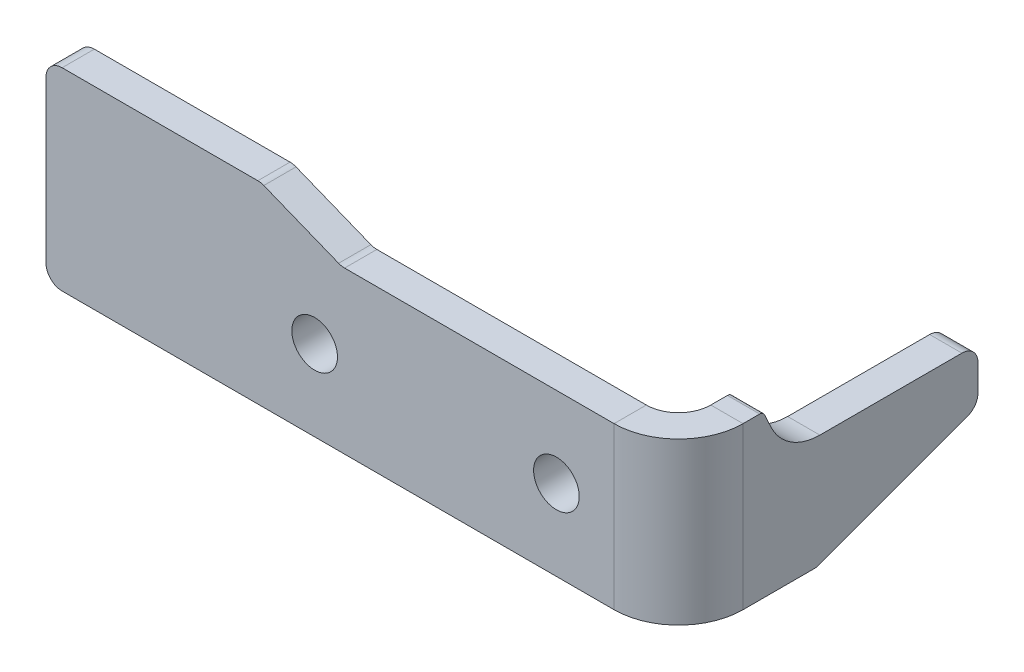
ISO-10303-21;
HEADER;
FILE_DESCRIPTION(('STEP AP214'),'2;1');
FILE_NAME('part.step','',(''),(''),'','','');
FILE_SCHEMA(('AUTOMOTIVE_DESIGN { 1 0 10303 214 1 1 1 1 }'));
ENDSEC;
DATA;
#1=APPLICATION_CONTEXT('core data for automotive mechanical design processes');
#2=APPLICATION_PROTOCOL_DEFINITION('international standard','automotive_design',2000,#1);
#3=PRODUCT_CONTEXT('',#1,'mechanical');
#4=PRODUCT('Part','Part','',(#3));
#5=PRODUCT_RELATED_PRODUCT_CATEGORY('part','',(#4));
#6=PRODUCT_DEFINITION_FORMATION('','',#4);
#7=PRODUCT_DEFINITION_CONTEXT('part definition',#1,'design');
#8=PRODUCT_DEFINITION('design','',#6,#7);
#9=PRODUCT_DEFINITION_SHAPE('','',#8);
#10=(LENGTH_UNIT() NAMED_UNIT(*) SI_UNIT(.MILLI.,.METRE.));
#11=(NAMED_UNIT(*) PLANE_ANGLE_UNIT() SI_UNIT($,.RADIAN.));
#12=(NAMED_UNIT(*) SI_UNIT($,.STERADIAN.) SOLID_ANGLE_UNIT());
#13=UNCERTAINTY_MEASURE_WITH_UNIT(LENGTH_MEASURE(1.E-05),#10,'distance_accuracy_value','');
#14=(GEOMETRIC_REPRESENTATION_CONTEXT(3) GLOBAL_UNCERTAINTY_ASSIGNED_CONTEXT((#13)) GLOBAL_UNIT_ASSIGNED_CONTEXT((#10,
#11,#12)) REPRESENTATION_CONTEXT('',''));
#15=CARTESIAN_POINT('',(0.,0.,0.));
#16=DIRECTION('',(0.,0.,1.));
#17=DIRECTION('',(1.,0.,0.));
#18=AXIS2_PLACEMENT_3D('',#15,#16,#17);
#19=CARTESIAN_POINT('',(-44.2674773439117,8.42261826174068,-10.0017601823175));
#20=DIRECTION('',(0.,-0.422618261740698,0.906307787036651));
#21=DIRECTION('',(0.,-0.906307787036651,-0.422618261740698));
#22=AXIS2_PLACEMENT_3D('',#19,#20,#21);
#23=PLANE('',#22);
#24=DIRECTION('',(0.,0.906307787036651,0.422618261740698));
#25=VECTOR('',#24,1.);
#26=CARTESIAN_POINT('',(-50.2674773439117,8.42261826174068,-10.0017601823175));
#27=LINE('',#26,#25);
#28=CARTESIAN_POINT('',(-50.2674773439117,5.77381738259303,-11.2369163171918));
#29=VERTEX_POINT('',#28);
#30=CARTESIAN_POINT('',(-50.2674773439117,8.42261826174068,-10.0017601823175));
#31=VERTEX_POINT('',#30);
#32=EDGE_CURVE('E230',#29,#31,#27,.T.);
#33=ORIENTED_EDGE('',*,*,#32,.T.);
#34=DIRECTION('',(-1.,0.,0.));
#35=VECTOR('',#34,1.);
#36=CARTESIAN_POINT('',(-44.2674773439117,8.42261826174068,-10.0017601823175));
#37=LINE('',#36,#35);
#38=CARTESIAN_POINT('',(-44.2674773439117,8.42261826174068,-10.0017601823175));
#39=VERTEX_POINT('',#38);
#40=EDGE_CURVE('E274',#39,#31,#37,.T.);
#41=ORIENTED_EDGE('',*,*,#40,.F.);
#42=DIRECTION('',(0.,0.906307787036651,0.422618261740698));
#43=VECTOR('',#42,1.);
#44=CARTESIAN_POINT('',(-44.2674773439117,8.42261826174068,-10.0017601823175));
#45=LINE('',#44,#43);
#46=CARTESIAN_POINT('',(-44.2674773439117,5.77381738259303,-11.2369163171918));
#47=VERTEX_POINT('',#46);
#48=EDGE_CURVE('E296',#47,#39,#45,.T.);
#49=ORIENTED_EDGE('',*,*,#48,.F.);
#50=DIRECTION('',(-1.,0.,0.));
#51=VECTOR('',#50,1.);
#52=CARTESIAN_POINT('',(-44.2674773439117,5.77381738259303,-11.2369163171918));
#53=LINE('',#52,#51);
#54=EDGE_CURVE('E232',#47,#29,#53,.T.);
#55=ORIENTED_EDGE('',*,*,#54,.T.);
#56=EDGE_LOOP('',(#33,#41,#49,#55));
#57=FACE_BOUND('',#56,.T.);
#58=ADVANCED_FACE('F39',(#57),#23,.F.);
#59=CARTESIAN_POINT('',(-44.2674773439117,10.,-20.2999941875583));
#60=DIRECTION('',(-1.,0.,0.));
#61=DIRECTION('',(0.,0.,1.));
#62=AXIS2_PLACEMENT_3D('',#59,#60,#61);
#63=CYLINDRICAL_SURFACE('',#62,10.);
#64=CARTESIAN_POINT('',(-50.2674773439117,10.,-20.2999941875583));
#65=DIRECTION('',(-1.,0.,0.));
#66=DIRECTION('',(0.,0.,-1.));
#67=AXIS2_PLACEMENT_3D('',#64,#65,#66);
#68=CIRCLE('',#67,10.);
#69=CARTESIAN_POINT('',(-50.2674773439117,0.,-20.2999941875583));
#70=VERTEX_POINT('',#69);
#71=EDGE_CURVE('E238',#70,#29,#68,.T.);
#72=ORIENTED_EDGE('',*,*,#71,.T.);
#73=ORIENTED_EDGE('',*,*,#54,.F.);
#74=CARTESIAN_POINT('',(-44.2674773439117,10.,-20.2999941875583));
#75=DIRECTION('',(-1.,0.,0.));
#76=DIRECTION('',(0.,0.,-1.));
#77=AXIS2_PLACEMENT_3D('',#74,#75,#76);
#78=CIRCLE('',#77,10.);
#79=CARTESIAN_POINT('',(-44.2674773439117,0.,-20.2999941875583));
#80=VERTEX_POINT('',#79);
#81=EDGE_CURVE('E294',#80,#47,#78,.T.);
#82=ORIENTED_EDGE('',*,*,#81,.F.);
#83=DIRECTION('',(-1.,0.,0.));
#84=VECTOR('',#83,1.);
#85=CARTESIAN_POINT('',(-44.2674773439117,0.,-20.2999941875583));
#86=LINE('',#85,#84);
#87=EDGE_CURVE('E240',#80,#70,#86,.T.);
#88=ORIENTED_EDGE('',*,*,#87,.T.);
#89=EDGE_LOOP('',(#72,#73,#82,#88));
#90=FACE_BOUND('',#89,.T.);
#91=ADVANCED_FACE('F396',(#90),#63,.F.);
#92=CARTESIAN_POINT('',(-44.2674773439117,0.,-20.2999941875583));
#93=DIRECTION('',(0.,-1.,0.));
#94=DIRECTION('',(-1.,0.,0.));
#95=AXIS2_PLACEMENT_3D('',#92,#93,#94);
#96=PLANE('',#95);
#97=DIRECTION('',(0.,0.,1.));
#98=VECTOR('',#97,1.);
#99=CARTESIAN_POINT('',(-50.2674773439117,0.,-20.2999941875583));
#100=LINE('',#99,#98);
#101=CARTESIAN_POINT('',(-50.2674773439118,0.,-46.7325226560883));
#102=VERTEX_POINT('',#101);
#103=EDGE_CURVE('E243',#102,#70,#100,.T.);
#104=ORIENTED_EDGE('',*,*,#103,.T.);
#105=ORIENTED_EDGE('',*,*,#87,.F.);
#106=DIRECTION('',(0.,0.,1.));
#107=VECTOR('',#106,1.);
#108=CARTESIAN_POINT('',(-44.2674773439117,0.,-20.2999941875583));
#109=LINE('',#108,#107);
#110=CARTESIAN_POINT('',(-44.2674773439118,0.,-46.7325226560884));
#111=VERTEX_POINT('',#110);
#112=EDGE_CURVE('E292',#111,#80,#109,.T.);
#113=ORIENTED_EDGE('',*,*,#112,.F.);
#114=DIRECTION('',(-1.,0.,0.));
#115=VECTOR('',#114,1.);
#116=CARTESIAN_POINT('',(-44.2674773439118,0.,-46.7325226560884));
#117=LINE('',#116,#115);
#118=EDGE_CURVE('E245',#111,#102,#117,.T.);
#119=ORIENTED_EDGE('',*,*,#118,.T.);
#120=EDGE_LOOP('',(#104,#105,#113,#119));
#121=FACE_BOUND('',#120,.T.);
#122=ADVANCED_FACE('F402',(#121),#96,.F.);
#123=CARTESIAN_POINT('',(-44.2674773439118,-3.,-46.7325226560884));
#124=DIRECTION('',(-1.,0.,0.));
#125=DIRECTION('',(0.,0.,1.));
#126=AXIS2_PLACEMENT_3D('',#123,#124,#125);
#127=CYLINDRICAL_SURFACE('',#126,3.);
#128=CARTESIAN_POINT('',(-50.2674773439118,-3.,-46.7325226560884));
#129=DIRECTION('',(1.,0.,0.));
#130=DIRECTION('',(0.,0.,1.));
#131=AXIS2_PLACEMENT_3D('',#128,#129,#130);
#132=CIRCLE('',#131,3.);
#133=CARTESIAN_POINT('',(-50.2674773439118,-3.00000000000002,-49.7325226560884));
#134=VERTEX_POINT('',#133);
#135=EDGE_CURVE('E248',#134,#102,#132,.T.);
#136=ORIENTED_EDGE('',*,*,#135,.T.);
#137=ORIENTED_EDGE('',*,*,#118,.F.);
#138=CARTESIAN_POINT('',(-44.2674773439118,-3.,-46.7325226560884));
#139=DIRECTION('',(1.,0.,0.));
#140=DIRECTION('',(0.,0.,1.));
#141=AXIS2_PLACEMENT_3D('',#138,#139,#140);
#142=CIRCLE('',#141,3.);
#143=CARTESIAN_POINT('',(-44.2674773439118,-3.00000000000002,-49.7325226560884));
#144=VERTEX_POINT('',#143);
#145=EDGE_CURVE('E290',#144,#111,#142,.T.);
#146=ORIENTED_EDGE('',*,*,#145,.F.);
#147=DIRECTION('',(-1.,0.,0.));
#148=VECTOR('',#147,1.);
#149=CARTESIAN_POINT('',(-44.2674773439118,-3.00000000000002,-49.7325226560884));
#150=LINE('',#149,#148);
#151=EDGE_CURVE('E250',#144,#134,#150,.T.);
#152=ORIENTED_EDGE('',*,*,#151,.T.);
#153=EDGE_LOOP('',(#136,#137,#146,#152));
#154=FACE_BOUND('',#153,.T.);
#155=ADVANCED_FACE('F411',(#154),#127,.T.);
#156=CARTESIAN_POINT('',(-44.2674773439118,-3.00000000000002,-49.7325226560884));
#157=DIRECTION('',(0.,0.,1.));
#158=DIRECTION('',(1.,0.,0.));
#159=AXIS2_PLACEMENT_3D('',#156,#157,#158);
#160=PLANE('',#159);
#161=DIRECTION('',(0.,1.,0.));
#162=VECTOR('',#161,1.);
#163=CARTESIAN_POINT('',(-50.2674773439118,-3.00000000000002,-49.7325226560884));
#164=LINE('',#163,#162);
#165=CARTESIAN_POINT('',(-50.2674773439118,-7.90469093826589,-49.7325226560884));
#166=VERTEX_POINT('',#165);
#167=EDGE_CURVE('E253',#166,#134,#164,.T.);
#168=ORIENTED_EDGE('',*,*,#167,.T.);
#169=ORIENTED_EDGE('',*,*,#151,.F.);
#170=DIRECTION('',(0.,1.,0.));
#171=VECTOR('',#170,1.);
#172=CARTESIAN_POINT('',(-44.2674773439118,-3.00000000000002,-49.7325226560884));
#173=LINE('',#172,#171);
#174=CARTESIAN_POINT('',(-44.2674773439118,-7.90469093826589,-49.7325226560884));
#175=VERTEX_POINT('',#174);
#176=EDGE_CURVE('E288',#175,#144,#173,.T.);
#177=ORIENTED_EDGE('',*,*,#176,.F.);
#178=DIRECTION('',(-1.,0.,0.));
#179=VECTOR('',#178,1.);
#180=CARTESIAN_POINT('',(-44.2674773439118,-7.90469093826589,-49.7325226560884));
#181=LINE('',#180,#179);
#182=EDGE_CURVE('E255',#175,#166,#181,.T.);
#183=ORIENTED_EDGE('',*,*,#182,.T.);
#184=EDGE_LOOP('',(#168,#169,#177,#183));
#185=FACE_BOUND('',#184,.T.);
#186=ADVANCED_FACE('F415',(#185),#160,.F.);
#187=CARTESIAN_POINT('',(-44.2674773439118,-7.90469093826591,-46.7325226560884));
#188=DIRECTION('',(-1.,0.,0.));
#189=DIRECTION('',(0.,0.,1.));
#190=AXIS2_PLACEMENT_3D('',#187,#188,#189);
#191=CYLINDRICAL_SURFACE('',#190,3.);
#192=CARTESIAN_POINT('',(-50.2674773439118,-7.90469093826591,-46.7325226560884));
#193=DIRECTION('',(1.,0.,0.));
#194=DIRECTION('',(0.,0.,-1.));
#195=AXIS2_PLACEMENT_3D('',#192,#193,#194);
#196=CIRCLE('',#195,3.);
#197=CARTESIAN_POINT('',(-50.2674773439118,-10.7213198859257,-47.7652866035636));
#198=VERTEX_POINT('',#197);
#199=EDGE_CURVE('E258',#198,#166,#196,.T.);
#200=ORIENTED_EDGE('',*,*,#199,.T.);
#201=ORIENTED_EDGE('',*,*,#182,.F.);
#202=CARTESIAN_POINT('',(-44.2674773439118,-7.90469093826591,-46.7325226560884));
#203=DIRECTION('',(1.,0.,0.));
#204=DIRECTION('',(0.,0.,-1.));
#205=AXIS2_PLACEMENT_3D('',#202,#203,#204);
#206=CIRCLE('',#205,3.);
#207=CARTESIAN_POINT('',(-44.2674773439118,-10.7213198859257,-47.7652866035636));
#208=VERTEX_POINT('',#207);
#209=EDGE_CURVE('E286',#208,#175,#206,.T.);
#210=ORIENTED_EDGE('',*,*,#209,.F.);
#211=DIRECTION('',(-1.,0.,0.));
#212=VECTOR('',#211,1.);
#213=CARTESIAN_POINT('',(-44.2674773439118,-10.7213198859257,-47.7652866035636));
#214=LINE('',#213,#212);
#215=EDGE_CURVE('E260',#208,#198,#214,.T.);
#216=ORIENTED_EDGE('',*,*,#215,.T.);
#217=EDGE_LOOP('',(#200,#201,#210,#216));
#218=FACE_BOUND('',#217,.T.);
#219=ADVANCED_FACE('F419',(#218),#191,.T.);
#220=CARTESIAN_POINT('',(-44.2674773439118,-10.7213198859257,-47.7652866035636));
#221=DIRECTION('',(0.,0.938876315886609,0.344254649158423));
#222=DIRECTION('',(0.,-0.344254649158423,0.938876315886609));
#223=AXIS2_PLACEMENT_3D('',#220,#221,#222);
#224=PLANE('',#223);
#225=DIRECTION('',(0.,0.344254649158423,-0.938876315886609));
#226=VECTOR('',#225,1.);
#227=CARTESIAN_POINT('',(-50.2674773439118,-10.7213198859257,-47.7652866035636));
#228=LINE('',#227,#226);
#229=CARTESIAN_POINT('',(-50.2674773439117,-20.8166289476598,-20.232625526107));
#230=VERTEX_POINT('',#229);
#231=EDGE_CURVE('E263',#230,#198,#228,.T.);
#232=ORIENTED_EDGE('',*,*,#231,.T.);
#233=ORIENTED_EDGE('',*,*,#215,.F.);
#234=DIRECTION('',(0.,0.344254649158423,-0.938876315886609));
#235=VECTOR('',#234,1.);
#236=CARTESIAN_POINT('',(-44.2674773439118,-10.7213198859257,-47.7652866035636));
#237=LINE('',#236,#235);
#238=CARTESIAN_POINT('',(-44.2674773439117,-20.8166289476598,-20.2326255261071));
#239=VERTEX_POINT('',#238);
#240=EDGE_CURVE('E284',#239,#208,#237,.T.);
#241=ORIENTED_EDGE('',*,*,#240,.F.);
#242=DIRECTION('',(-1.,0.,0.));
#243=VECTOR('',#242,1.);
#244=CARTESIAN_POINT('',(-44.2674773439117,-20.8166289476598,-20.2326255261071));
#245=LINE('',#244,#243);
#246=EDGE_CURVE('E265',#239,#230,#245,.T.);
#247=ORIENTED_EDGE('',*,*,#246,.T.);
#248=EDGE_LOOP('',(#232,#233,#241,#247));
#249=FACE_BOUND('',#248,.T.);
#250=ADVANCED_FACE('F423',(#249),#224,.F.);
#251=CARTESIAN_POINT('',(-44.2674773439117,-18.,-19.1998615786318));
#252=DIRECTION('',(-1.,0.,0.));
#253=DIRECTION('',(0.,0.,1.));
#254=AXIS2_PLACEMENT_3D('',#251,#252,#253);
#255=CYLINDRICAL_SURFACE('',#254,3.);
#256=CARTESIAN_POINT('',(-50.2674773439117,-18.,-19.1998615786318));
#257=DIRECTION('',(1.,0.,0.));
#258=DIRECTION('',(0.,0.,1.));
#259=AXIS2_PLACEMENT_3D('',#256,#257,#258);
#260=CIRCLE('',#259,3.);
#261=CARTESIAN_POINT('',(-50.2674773439117,-21.,-19.1998615786318));
#262=VERTEX_POINT('',#261);
#263=EDGE_CURVE('E268',#262,#230,#260,.T.);
#264=ORIENTED_EDGE('',*,*,#263,.T.);
#265=ORIENTED_EDGE('',*,*,#246,.F.);
#266=CARTESIAN_POINT('',(-44.2674773439117,-18.,-19.1998615786318));
#267=DIRECTION('',(1.,0.,0.));
#268=DIRECTION('',(0.,0.,1.));
#269=AXIS2_PLACEMENT_3D('',#266,#267,#268);
#270=CIRCLE('',#269,3.);
#271=CARTESIAN_POINT('',(-44.2674773439117,-21.,-19.1998615786318));
#272=VERTEX_POINT('',#271);
#273=EDGE_CURVE('E282',#272,#239,#270,.T.);
#274=ORIENTED_EDGE('',*,*,#273,.F.);
#275=DIRECTION('',(-1.,0.,0.));
#276=VECTOR('',#275,1.);
#277=CARTESIAN_POINT('',(-44.2674773439117,-21.,-19.1998615786318));
#278=LINE('',#277,#276);
#279=EDGE_CURVE('E270',#272,#262,#278,.T.);
#280=ORIENTED_EDGE('',*,*,#279,.T.);
#281=EDGE_LOOP('',(#264,#265,#274,#280));
#282=FACE_BOUND('',#281,.T.);
#283=ADVANCED_FACE('F427',(#282),#255,.T.);
#284=CARTESIAN_POINT('',(-44.2674773439117,7.99999999999999,-9.0954523952809));
#285=DIRECTION('',(-1.,0.,0.));
#286=DIRECTION('',(0.,0.,1.));
#287=AXIS2_PLACEMENT_3D('',#284,#285,#286);
#288=CYLINDRICAL_SURFACE('',#287,1.);
#289=CARTESIAN_POINT('',(-50.2674773439117,7.99999999999999,-9.09545239528087));
#290=DIRECTION('',(1.,0.,0.));
#291=DIRECTION('',(0.,0.,1.));
#292=AXIS2_PLACEMENT_3D('',#289,#290,#291);
#293=CIRCLE('',#292,1.);
#294=CARTESIAN_POINT('',(-50.2674773439117,8.99999999999999,-9.09545239528087));
#295=VERTEX_POINT('',#294);
#296=EDGE_CURVE('E272',#31,#295,#293,.T.);
#297=ORIENTED_EDGE('',*,*,#296,.T.);
#298=DIRECTION('',(-1.,0.,0.));
#299=VECTOR('',#298,1.);
#300=CARTESIAN_POINT('',(-44.2674773439117,8.99999999999999,-9.0954523952809));
#301=LINE('',#300,#299);
#302=CARTESIAN_POINT('',(-44.2674773439117,8.99999999999999,-9.0954523952809));
#303=VERTEX_POINT('',#302);
#304=EDGE_CURVE('E277',#303,#295,#301,.T.);
#305=ORIENTED_EDGE('',*,*,#304,.F.);
#306=CARTESIAN_POINT('',(-44.2674773439117,7.99999999999999,-9.0954523952809));
#307=DIRECTION('',(1.,0.,0.));
#308=DIRECTION('',(0.,0.,1.));
#309=AXIS2_PLACEMENT_3D('',#306,#307,#308);
#310=CIRCLE('',#309,1.);
#311=EDGE_CURVE('E203',#39,#303,#310,.T.);
#312=ORIENTED_EDGE('',*,*,#311,.F.);
#313=ORIENTED_EDGE('',*,*,#40,.T.);
#314=EDGE_LOOP('',(#297,#305,#312,#313));
#315=FACE_BOUND('',#314,.T.);
#316=ADVANCED_FACE('F431',(#315),#288,.T.);
#317=CARTESIAN_POINT('',(-44.2674773439114,8.99999999999999,56.6897301332098));
#318=DIRECTION('',(0.,-1.,0.));
#319=DIRECTION('',(0.,0.,-1.));
#320=AXIS2_PLACEMENT_3D('',#317,#318,#319);
#321=PLANE('',#320);
#322=DIRECTION('',(-1.,0.,0.));
#323=VECTOR('',#322,1.);
#324=CARTESIAN_POINT('',(-44.2674773439117,8.99999999999999,-6.00000000000003));
#325=LINE('',#324,#323);
#326=CARTESIAN_POINT('',(-44.2674773439117,8.99999999999998,-6.));
#327=VERTEX_POINT('',#326);
#328=CARTESIAN_POINT('',(-50.2674773439117,8.99999999999999,-6.00000000000001));
#329=VERTEX_POINT('',#328);
#330=EDGE_CURVE('E43',#327,#329,#325,.T.);
#331=ORIENTED_EDGE('',*,*,#330,.F.);
#332=DIRECTION('',(0.,0.,1.));
#333=VECTOR('',#332,1.);
#334=CARTESIAN_POINT('',(-44.2674773439114,8.99999999999999,56.6897301332098));
#335=LINE('',#334,#333);
#336=EDGE_CURVE('E199',#303,#327,#335,.T.);
#337=ORIENTED_EDGE('',*,*,#336,.F.);
#338=ORIENTED_EDGE('',*,*,#304,.T.);
#339=DIRECTION('',(0.,0.,1.));
#340=VECTOR('',#339,1.);
#341=CARTESIAN_POINT('',(-50.2674773439114,8.99999999999999,56.6897301332098));
#342=LINE('',#341,#340);
#343=EDGE_CURVE('E211',#295,#329,#342,.T.);
#344=ORIENTED_EDGE('',*,*,#343,.T.);
#345=EDGE_LOOP('',(#331,#337,#338,#344));
#346=FACE_BOUND('',#345,.T.);
#347=ADVANCED_FACE('F210',(#346),#321,.F.);
#348=CARTESIAN_POINT('',(-44.2674773439113,-18.,109.267477343912));
#349=DIRECTION('',(-1.,0.,0.));
#350=DIRECTION('',(0.,0.,1.));
#351=AXIS2_PLACEMENT_3D('',#348,#349,#350);
#352=PLANE('',#351);
#353=DIRECTION('',(0.,1.,0.));
#354=VECTOR('',#353,1.);
#355=CARTESIAN_POINT('',(-44.2674773439117,-18.,-6.00000000000005));
#356=LINE('',#355,#354);
#357=CARTESIAN_POINT('',(-44.2674773439117,-21.,-6.00000000000004));
#358=VERTEX_POINT('',#357);
#359=EDGE_CURVE('E125',#358,#327,#356,.T.);
#360=ORIENTED_EDGE('',*,*,#359,.F.);
#361=DIRECTION('',(0.,0.,-1.));
#362=VECTOR('',#361,1.);
#363=CARTESIAN_POINT('',(-44.2674773439117,-21.,-19.1998615786318));
#364=LINE('',#363,#362);
#365=EDGE_CURVE('E280',#358,#272,#364,.T.);
#366=ORIENTED_EDGE('',*,*,#365,.T.);
#367=ORIENTED_EDGE('',*,*,#273,.T.);
#368=ORIENTED_EDGE('',*,*,#240,.T.);
#369=ORIENTED_EDGE('',*,*,#209,.T.);
#370=ORIENTED_EDGE('',*,*,#176,.T.);
#371=ORIENTED_EDGE('',*,*,#145,.T.);
#372=ORIENTED_EDGE('',*,*,#112,.T.);
#373=ORIENTED_EDGE('',*,*,#81,.T.);
#374=ORIENTED_EDGE('',*,*,#48,.T.);
#375=ORIENTED_EDGE('',*,*,#311,.T.);
#376=ORIENTED_EDGE('',*,*,#336,.T.);
#377=EDGE_LOOP('',(#360,#366,#367,#368,#369,#370,#371,#372,#373,#374,#375,#376));
#378=FACE_BOUND('',#377,.T.);
#379=ADVANCED_FACE('F201',(#378),#352,.F.);
#380=CARTESIAN_POINT('',(-44.2674773439117,-21.,-19.1998615786318));
#381=DIRECTION('',(0.,1.,0.));
#382=DIRECTION('',(0.,0.,1.));
#383=AXIS2_PLACEMENT_3D('',#380,#381,#382);
#384=PLANE('',#383);
#385=DIRECTION('',(1.,0.,0.));
#386=VECTOR('',#385,1.);
#387=CARTESIAN_POINT('',(-44.2674773439117,-21.,-6.00000000000004));
#388=LINE('',#387,#386);
#389=CARTESIAN_POINT('',(-50.2674773439117,-21.,-6.00000000000002));
#390=VERTEX_POINT('',#389);
#391=EDGE_CURVE('E215',#390,#358,#388,.T.);
#392=ORIENTED_EDGE('',*,*,#391,.F.);
#393=DIRECTION('',(0.,0.,-1.));
#394=VECTOR('',#393,1.);
#395=CARTESIAN_POINT('',(-50.2674773439117,-21.,-19.1998615786318));
#396=LINE('',#395,#394);
#397=EDGE_CURVE('E49',#390,#262,#396,.T.);
#398=ORIENTED_EDGE('',*,*,#397,.T.);
#399=ORIENTED_EDGE('',*,*,#279,.F.);
#400=ORIENTED_EDGE('',*,*,#365,.F.);
#401=EDGE_LOOP('',(#392,#398,#399,#400));
#402=FACE_BOUND('',#401,.T.);
#403=ADVANCED_FACE('F439',(#402),#384,.F.);
#404=CARTESIAN_POINT('',(-50.2674773439113,-18.,109.267477343912));
#405=DIRECTION('',(-1.,0.,0.));
#406=DIRECTION('',(0.,0.,1.));
#407=AXIS2_PLACEMENT_3D('',#404,#405,#406);
#408=PLANE('',#407);
#409=ORIENTED_EDGE('',*,*,#397,.F.);
#410=DIRECTION('',(0.,1.,0.));
#411=VECTOR('',#410,1.);
#412=CARTESIAN_POINT('',(-50.2674773439117,-18.,-6.00000000000003));
#413=LINE('',#412,#411);
#414=EDGE_CURVE('E11',#390,#329,#413,.T.);
#415=ORIENTED_EDGE('',*,*,#414,.T.);
#416=ORIENTED_EDGE('',*,*,#343,.F.);
#417=ORIENTED_EDGE('',*,*,#296,.F.);
#418=ORIENTED_EDGE('',*,*,#32,.F.);
#419=ORIENTED_EDGE('',*,*,#71,.F.);
#420=ORIENTED_EDGE('',*,*,#103,.F.);
#421=ORIENTED_EDGE('',*,*,#135,.F.);
#422=ORIENTED_EDGE('',*,*,#167,.F.);
#423=ORIENTED_EDGE('',*,*,#199,.F.);
#424=ORIENTED_EDGE('',*,*,#231,.F.);
#425=ORIENTED_EDGE('',*,*,#263,.F.);
#426=EDGE_LOOP('',(#409,#415,#416,#417,#418,#419,#420,#421,#422,#423,#424,#425));
#427=FACE_BOUND('',#426,.T.);
#428=ADVANCED_FACE('F41',(#427),#408,.T.);
#429=CARTESIAN_POINT('',(-159.,-18.,6.));
#430=DIRECTION('',(0.,0.,-1.));
#431=DIRECTION('',(-1.,0.,0.));
#432=AXIS2_PLACEMENT_3D('',#429,#430,#431);
#433=PLANE('',#432);
#434=CARTESIAN_POINT('',(-67.,-6.00000000000002,6.));
#435=DIRECTION('',(0.,0.,1.));
#436=DIRECTION('',(1.,0.,0.));
#437=AXIS2_PLACEMENT_3D('',#434,#435,#436);
#438=CIRCLE('',#437,4.25000000000001);
#439=CARTESIAN_POINT('',(-62.75,-6.00000000000002,6.));
#440=VERTEX_POINT('',#439);
#441=EDGE_CURVE('E355',#440,#440,#438,.T.);
#442=ORIENTED_EDGE('',*,*,#441,.F.);
#443=EDGE_LOOP('',(#442));
#444=FACE_BOUND('',#443,.T.);
#445=CARTESIAN_POINT('',(-112.,-6.00000000000002,6.));
#446=DIRECTION('',(0.,0.,1.));
#447=DIRECTION('',(1.,0.,0.));
#448=AXIS2_PLACEMENT_3D('',#445,#446,#447);
#449=CIRCLE('',#448,4.25000000000001);
#450=CARTESIAN_POINT('',(-107.75,-6.00000000000002,6.));
#451=VERTEX_POINT('',#450);
#452=EDGE_CURVE('E371',#451,#451,#449,.T.);
#453=ORIENTED_EDGE('',*,*,#452,.F.);
#454=EDGE_LOOP('',(#453));
#455=FACE_BOUND('',#454,.T.);
#456=DIRECTION('',(1.,0.,0.));
#457=VECTOR('',#456,1.);
#458=CARTESIAN_POINT('',(-30.5326610774566,-21.,6.));
#459=LINE('',#458,#457);
#460=CARTESIAN_POINT('',(-159.,-21.,6.));
#461=VERTEX_POINT('',#460);
#462=CARTESIAN_POINT('',(-56.2674773439117,-21.,6.));
#463=VERTEX_POINT('',#462);
#464=EDGE_CURVE('E304',#461,#463,#459,.T.);
#465=ORIENTED_EDGE('',*,*,#464,.T.);
#466=DIRECTION('',(0.,1.,0.));
#467=VECTOR('',#466,1.);
#468=CARTESIAN_POINT('',(-56.2674773439117,-18.,6.));
#469=LINE('',#468,#467);
#470=CARTESIAN_POINT('',(-56.2674773439117,8.99999999999999,6.));
#471=VERTEX_POINT('',#470);
#472=EDGE_CURVE('E313',#463,#471,#469,.T.);
#473=ORIENTED_EDGE('',*,*,#472,.T.);
#474=DIRECTION('',(-1.,0.,0.));
#475=VECTOR('',#474,1.);
#476=CARTESIAN_POINT('',(-106.422252789298,8.99999999999999,6.));
#477=LINE('',#476,#475);
#478=CARTESIAN_POINT('',(-106.422252789298,8.99999999999999,6.));
#479=VERTEX_POINT('',#478);
#480=EDGE_CURVE('E306',#471,#479,#477,.T.);
#481=ORIENTED_EDGE('',*,*,#480,.T.);
#482=CARTESIAN_POINT('',(-106.422252789298,12.,6.));
#483=DIRECTION('',(0.,0.,-1.));
#484=DIRECTION('',(1.,0.,0.));
#485=AXIS2_PLACEMENT_3D('',#482,#483,#484);
#486=CIRCLE('',#485,2.99999999999997);
#487=CARTESIAN_POINT('',(-107.536424818361,9.21456992734421,6.));
#488=VERTEX_POINT('',#487);
#489=EDGE_CURVE('E309',#479,#488,#486,.T.);
#490=ORIENTED_EDGE('',*,*,#489,.T.);
#491=DIRECTION('',(-0.92847669088526,0.371390676354103,0.));
#492=VECTOR('',#491,1.);
#493=CARTESIAN_POINT('',(-107.536424818361,9.21456992734421,6.));
#494=LINE('',#493,#492);
#495=CARTESIAN_POINT('',(-121.463575181639,14.7854300726558,6.));
#496=VERTEX_POINT('',#495);
#497=EDGE_CURVE('E363',#488,#496,#494,.T.);
#498=ORIENTED_EDGE('',*,*,#497,.T.);
#499=CARTESIAN_POINT('',(-122.577747210702,12.,6.));
#500=DIRECTION('',(0.,0.,1.));
#501=DIRECTION('',(1.,0.,0.));
#502=AXIS2_PLACEMENT_3D('',#499,#500,#501);
#503=CIRCLE('',#502,2.99999999999998);
#504=CARTESIAN_POINT('',(-122.577747210702,15.,6.));
#505=VERTEX_POINT('',#504);
#506=EDGE_CURVE('E361',#496,#505,#503,.T.);
#507=ORIENTED_EDGE('',*,*,#506,.T.);
#508=DIRECTION('',(-1.,0.,0.));
#509=VECTOR('',#508,1.);
#510=CARTESIAN_POINT('',(-122.577747210702,15.,6.));
#511=LINE('',#510,#509);
#512=CARTESIAN_POINT('',(-159.,15.,6.));
#513=VERTEX_POINT('',#512);
#514=EDGE_CURVE('E359',#505,#513,#511,.T.);
#515=ORIENTED_EDGE('',*,*,#514,.T.);
#516=CARTESIAN_POINT('',(-159.,12.,6.));
#517=DIRECTION('',(0.,0.,1.));
#518=DIRECTION('',(1.,0.,0.));
#519=AXIS2_PLACEMENT_3D('',#516,#517,#518);
#520=CIRCLE('',#519,2.99999999999999);
#521=CARTESIAN_POINT('',(-162.,12.,6.));
#522=VERTEX_POINT('',#521);
#523=EDGE_CURVE('E357',#513,#522,#520,.T.);
#524=ORIENTED_EDGE('',*,*,#523,.T.);
#525=DIRECTION('',(0.,-1.,0.));
#526=VECTOR('',#525,1.);
#527=CARTESIAN_POINT('',(-162.,12.,6.));
#528=LINE('',#527,#526);
#529=CARTESIAN_POINT('',(-162.,-18.,6.));
#530=VERTEX_POINT('',#529);
#531=EDGE_CURVE('E341',#522,#530,#528,.T.);
#532=ORIENTED_EDGE('',*,*,#531,.T.);
#533=CARTESIAN_POINT('',(-159.,-18.,6.));
#534=DIRECTION('',(0.,0.,1.));
#535=DIRECTION('',(-1.,0.,0.));
#536=AXIS2_PLACEMENT_3D('',#533,#534,#535);
#537=CIRCLE('',#536,3.);
#538=EDGE_CURVE('E307',#530,#461,#537,.T.);
#539=ORIENTED_EDGE('',*,*,#538,.T.);
#540=EDGE_LOOP('',(#465,#473,#481,#490,#498,#507,#515,#524,#532,#539));
#541=FACE_BOUND('',#540,.T.);
#542=ADVANCED_FACE('F444',(#444,#455,#541),#433,.F.);
#543=CARTESIAN_POINT('',(-30.5326610774566,-21.,6.));
#544=DIRECTION('',(0.,1.,0.));
#545=DIRECTION('',(-1.,0.,0.));
#546=AXIS2_PLACEMENT_3D('',#543,#544,#545);
#547=PLANE('',#546);
#548=DIRECTION('',(1.,0.,0.));
#549=VECTOR('',#548,1.);
#550=CARTESIAN_POINT('',(-30.5326610774566,-21.,0.));
#551=LINE('',#550,#549);
#552=CARTESIAN_POINT('',(-159.,-21.,0.));
#553=VERTEX_POINT('',#552);
#554=CARTESIAN_POINT('',(-56.2674773439117,-21.,0.));
#555=VERTEX_POINT('',#554);
#556=EDGE_CURVE('E303',#553,#555,#551,.T.);
#557=ORIENTED_EDGE('',*,*,#556,.T.);
#558=DIRECTION('',(0.,0.,1.));
#559=VECTOR('',#558,1.);
#560=CARTESIAN_POINT('',(-56.2674773439117,-21.,6.));
#561=LINE('',#560,#559);
#562=EDGE_CURVE('E137',#555,#463,#561,.T.);
#563=ORIENTED_EDGE('',*,*,#562,.T.);
#564=ORIENTED_EDGE('',*,*,#464,.F.);
#565=DIRECTION('',(0.,0.,-1.));
#566=VECTOR('',#565,1.);
#567=CARTESIAN_POINT('',(-159.,-21.,6.));
#568=LINE('',#567,#566);
#569=EDGE_CURVE('E317',#461,#553,#568,.T.);
#570=ORIENTED_EDGE('',*,*,#569,.T.);
#571=EDGE_LOOP('',(#557,#563,#564,#570));
#572=FACE_BOUND('',#571,.T.);
#573=ADVANCED_FACE('F473',(#572),#547,.F.);
#574=CARTESIAN_POINT('',(-106.422252789298,8.99999999999999,6.));
#575=DIRECTION('',(0.,-1.,0.));
#576=DIRECTION('',(1.,0.,0.));
#577=AXIS2_PLACEMENT_3D('',#574,#575,#576);
#578=PLANE('',#577);
#579=ORIENTED_EDGE('',*,*,#480,.F.);
#580=DIRECTION('',(0.,0.,-1.));
#581=VECTOR('',#580,1.);
#582=CARTESIAN_POINT('',(-56.2674773439117,8.99999999999999,6.));
#583=LINE('',#582,#581);
#584=CARTESIAN_POINT('',(-56.2674773439117,8.99999999999998,0.));
#585=VERTEX_POINT('',#584);
#586=EDGE_CURVE('E221',#471,#585,#583,.T.);
#587=ORIENTED_EDGE('',*,*,#586,.T.);
#588=DIRECTION('',(-1.,0.,0.));
#589=VECTOR('',#588,1.);
#590=CARTESIAN_POINT('',(-106.422252789298,8.99999999999999,0.));
#591=LINE('',#590,#589);
#592=CARTESIAN_POINT('',(-106.422252789298,8.99999999999999,0.));
#593=VERTEX_POINT('',#592);
#594=EDGE_CURVE('E300',#585,#593,#591,.T.);
#595=ORIENTED_EDGE('',*,*,#594,.T.);
#596=DIRECTION('',(0.,0.,-1.));
#597=VECTOR('',#596,1.);
#598=CARTESIAN_POINT('',(-106.422252789298,8.99999999999999,6.));
#599=LINE('',#598,#597);
#600=EDGE_CURVE('E320',#479,#593,#599,.T.);
#601=ORIENTED_EDGE('',*,*,#600,.F.);
#602=EDGE_LOOP('',(#579,#587,#595,#601));
#603=FACE_BOUND('',#602,.T.);
#604=ADVANCED_FACE('F479',(#603),#578,.F.);
#605=CARTESIAN_POINT('',(-159.,-18.,0.));
#606=DIRECTION('',(0.,0.,-1.));
#607=DIRECTION('',(-1.,0.,0.));
#608=AXIS2_PLACEMENT_3D('',#605,#606,#607);
#609=PLANE('',#608);
#610=DIRECTION('',(0.,1.,0.));
#611=VECTOR('',#610,1.);
#612=CARTESIAN_POINT('',(-56.2674773439117,-18.,0.));
#613=LINE('',#612,#611);
#614=EDGE_CURVE('E145',#555,#585,#613,.T.);
#615=ORIENTED_EDGE('',*,*,#614,.F.);
#616=ORIENTED_EDGE('',*,*,#556,.F.);
#617=CARTESIAN_POINT('',(-159.,-18.,0.));
#618=DIRECTION('',(0.,0.,1.));
#619=DIRECTION('',(-1.,0.,0.));
#620=AXIS2_PLACEMENT_3D('',#617,#618,#619);
#621=CIRCLE('',#620,3.);
#622=CARTESIAN_POINT('',(-162.,-18.,0.));
#623=VERTEX_POINT('',#622);
#624=EDGE_CURVE('E311',#623,#553,#621,.T.);
#625=ORIENTED_EDGE('',*,*,#624,.F.);
#626=DIRECTION('',(0.,-1.,0.));
#627=VECTOR('',#626,1.);
#628=CARTESIAN_POINT('',(-162.,12.,0.));
#629=LINE('',#628,#627);
#630=CARTESIAN_POINT('',(-162.,12.,0.));
#631=VERTEX_POINT('',#630);
#632=EDGE_CURVE('E342',#631,#623,#629,.T.);
#633=ORIENTED_EDGE('',*,*,#632,.F.);
#634=CARTESIAN_POINT('',(-159.,12.,0.));
#635=DIRECTION('',(0.,0.,1.));
#636=DIRECTION('',(1.,0.,0.));
#637=AXIS2_PLACEMENT_3D('',#634,#635,#636);
#638=CIRCLE('',#637,2.99999999999999);
#639=CARTESIAN_POINT('',(-159.,15.,0.));
#640=VERTEX_POINT('',#639);
#641=EDGE_CURVE('E344',#640,#631,#638,.T.);
#642=ORIENTED_EDGE('',*,*,#641,.F.);
#643=DIRECTION('',(-1.,0.,0.));
#644=VECTOR('',#643,1.);
#645=CARTESIAN_POINT('',(-122.577747210702,15.,0.));
#646=LINE('',#645,#644);
#647=CARTESIAN_POINT('',(-122.577747210702,15.,0.));
#648=VERTEX_POINT('',#647);
#649=EDGE_CURVE('E346',#648,#640,#646,.T.);
#650=ORIENTED_EDGE('',*,*,#649,.F.);
#651=CARTESIAN_POINT('',(-122.577747210702,12.,0.));
#652=DIRECTION('',(0.,0.,1.));
#653=DIRECTION('',(1.,0.,0.));
#654=AXIS2_PLACEMENT_3D('',#651,#652,#653);
#655=CIRCLE('',#654,2.99999999999998);
#656=CARTESIAN_POINT('',(-121.463575181639,14.7854300726558,0.));
#657=VERTEX_POINT('',#656);
#658=EDGE_CURVE('E348',#657,#648,#655,.T.);
#659=ORIENTED_EDGE('',*,*,#658,.F.);
#660=DIRECTION('',(-0.92847669088526,0.371390676354103,0.));
#661=VECTOR('',#660,1.);
#662=CARTESIAN_POINT('',(-107.536424818361,9.21456992734421,0.));
#663=LINE('',#662,#661);
#664=CARTESIAN_POINT('',(-107.536424818361,9.21456992734421,0.));
#665=VERTEX_POINT('',#664);
#666=EDGE_CURVE('E350',#665,#657,#663,.T.);
#667=ORIENTED_EDGE('',*,*,#666,.F.);
#668=CARTESIAN_POINT('',(-106.422252789298,12.,0.));
#669=DIRECTION('',(0.,0.,-1.));
#670=DIRECTION('',(1.,0.,0.));
#671=AXIS2_PLACEMENT_3D('',#668,#669,#670);
#672=CIRCLE('',#671,2.99999999999997);
#673=EDGE_CURVE('E302',#593,#665,#672,.T.);
#674=ORIENTED_EDGE('',*,*,#673,.F.);
#675=ORIENTED_EDGE('',*,*,#594,.F.);
#676=EDGE_LOOP('',(#615,#616,#625,#633,#642,#650,#659,#667,#674,#675));
#677=FACE_BOUND('',#676,.T.);
#678=CARTESIAN_POINT('',(-67.,-6.00000000000002,0.));
#679=DIRECTION('',(0.,0.,1.));
#680=DIRECTION('',(1.,0.,0.));
#681=AXIS2_PLACEMENT_3D('',#678,#679,#680);
#682=CIRCLE('',#681,4.25000000000001);
#683=CARTESIAN_POINT('',(-62.75,-6.00000000000002,0.));
#684=VERTEX_POINT('',#683);
#685=EDGE_CURVE('E368',#684,#684,#682,.T.);
#686=ORIENTED_EDGE('',*,*,#685,.T.);
#687=EDGE_LOOP('',(#686));
#688=FACE_BOUND('',#687,.T.);
#689=CARTESIAN_POINT('',(-112.,-6.00000000000002,0.));
#690=DIRECTION('',(0.,0.,1.));
#691=DIRECTION('',(1.,0.,0.));
#692=AXIS2_PLACEMENT_3D('',#689,#690,#691);
#693=CIRCLE('',#692,4.25000000000001);
#694=CARTESIAN_POINT('',(-107.75,-6.00000000000002,0.));
#695=VERTEX_POINT('',#694);
#696=EDGE_CURVE('E224',#695,#695,#693,.T.);
#697=ORIENTED_EDGE('',*,*,#696,.T.);
#698=EDGE_LOOP('',(#697));
#699=FACE_BOUND('',#698,.T.);
#700=ADVANCED_FACE('F406',(#677,#688,#699),#609,.T.);
#701=CARTESIAN_POINT('',(-159.,-18.,6.));
#702=DIRECTION('',(0.,0.,-1.));
#703=DIRECTION('',(-1.,0.,0.));
#704=AXIS2_PLACEMENT_3D('',#701,#702,#703);
#705=CYLINDRICAL_SURFACE('',#704,3.);
#706=ORIENTED_EDGE('',*,*,#624,.T.);
#707=ORIENTED_EDGE('',*,*,#569,.F.);
#708=ORIENTED_EDGE('',*,*,#538,.F.);
#709=DIRECTION('',(0.,0.,-1.));
#710=VECTOR('',#709,1.);
#711=CARTESIAN_POINT('',(-162.,-18.,6.));
#712=LINE('',#711,#710);
#713=EDGE_CURVE('E338',#530,#623,#712,.T.);
#714=ORIENTED_EDGE('',*,*,#713,.T.);
#715=EDGE_LOOP('',(#706,#707,#708,#714));
#716=FACE_BOUND('',#715,.T.);
#717=ADVANCED_FACE('F486',(#716),#705,.T.);
#718=CARTESIAN_POINT('',(-106.422252789298,12.,6.));
#719=DIRECTION('',(0.,0.,-1.));
#720=DIRECTION('',(-1.,0.,0.));
#721=AXIS2_PLACEMENT_3D('',#718,#719,#720);
#722=CYLINDRICAL_SURFACE('',#721,2.99999999999997);
#723=ORIENTED_EDGE('',*,*,#673,.T.);
#724=DIRECTION('',(0.,0.,-1.));
#725=VECTOR('',#724,1.);
#726=CARTESIAN_POINT('',(-107.536424818361,9.21456992734421,6.));
#727=LINE('',#726,#725);
#728=EDGE_CURVE('E323',#488,#665,#727,.T.);
#729=ORIENTED_EDGE('',*,*,#728,.F.);
#730=ORIENTED_EDGE('',*,*,#489,.F.);
#731=ORIENTED_EDGE('',*,*,#600,.T.);
#732=EDGE_LOOP('',(#723,#729,#730,#731));
#733=FACE_BOUND('',#732,.T.);
#734=ADVANCED_FACE('F489',(#733),#722,.F.);
#735=CARTESIAN_POINT('',(-107.536424818361,9.21456992734421,6.));
#736=DIRECTION('',(-0.371390676354103,-0.928476690885259,0.));
#737=DIRECTION('',(0.92847669088526,-0.371390676354103,0.));
#738=AXIS2_PLACEMENT_3D('',#735,#736,#737);
#739=PLANE('',#738);
#740=ORIENTED_EDGE('',*,*,#666,.T.);
#741=DIRECTION('',(0.,0.,-1.));
#742=VECTOR('',#741,1.);
#743=CARTESIAN_POINT('',(-121.463575181639,14.7854300726558,6.));
#744=LINE('',#743,#742);
#745=EDGE_CURVE('E326',#496,#657,#744,.T.);
#746=ORIENTED_EDGE('',*,*,#745,.F.);
#747=ORIENTED_EDGE('',*,*,#497,.F.);
#748=ORIENTED_EDGE('',*,*,#728,.T.);
#749=EDGE_LOOP('',(#740,#746,#747,#748));
#750=FACE_BOUND('',#749,.T.);
#751=ADVANCED_FACE('F493',(#750),#739,.F.);
#752=CARTESIAN_POINT('',(-122.577747210702,12.,6.));
#753=DIRECTION('',(0.,0.,-1.));
#754=DIRECTION('',(-1.,0.,0.));
#755=AXIS2_PLACEMENT_3D('',#752,#753,#754);
#756=CYLINDRICAL_SURFACE('',#755,2.99999999999998);
#757=ORIENTED_EDGE('',*,*,#658,.T.);
#758=DIRECTION('',(0.,0.,-1.));
#759=VECTOR('',#758,1.);
#760=CARTESIAN_POINT('',(-122.577747210702,15.,6.));
#761=LINE('',#760,#759);
#762=EDGE_CURVE('E329',#505,#648,#761,.T.);
#763=ORIENTED_EDGE('',*,*,#762,.F.);
#764=ORIENTED_EDGE('',*,*,#506,.F.);
#765=ORIENTED_EDGE('',*,*,#745,.T.);
#766=EDGE_LOOP('',(#757,#763,#764,#765));
#767=FACE_BOUND('',#766,.T.);
#768=ADVANCED_FACE('F497',(#767),#756,.T.);
#769=CARTESIAN_POINT('',(-122.577747210702,15.,6.));
#770=DIRECTION('',(0.,-1.,0.));
#771=DIRECTION('',(1.,0.,0.));
#772=AXIS2_PLACEMENT_3D('',#769,#770,#771);
#773=PLANE('',#772);
#774=ORIENTED_EDGE('',*,*,#649,.T.);
#775=DIRECTION('',(0.,0.,-1.));
#776=VECTOR('',#775,1.);
#777=CARTESIAN_POINT('',(-159.,15.,6.));
#778=LINE('',#777,#776);
#779=EDGE_CURVE('E332',#513,#640,#778,.T.);
#780=ORIENTED_EDGE('',*,*,#779,.F.);
#781=ORIENTED_EDGE('',*,*,#514,.F.);
#782=ORIENTED_EDGE('',*,*,#762,.T.);
#783=EDGE_LOOP('',(#774,#780,#781,#782));
#784=FACE_BOUND('',#783,.T.);
#785=ADVANCED_FACE('F501',(#784),#773,.F.);
#786=CARTESIAN_POINT('',(-159.,12.,6.));
#787=DIRECTION('',(0.,0.,-1.));
#788=DIRECTION('',(-1.,0.,0.));
#789=AXIS2_PLACEMENT_3D('',#786,#787,#788);
#790=CYLINDRICAL_SURFACE('',#789,2.99999999999999);
#791=ORIENTED_EDGE('',*,*,#641,.T.);
#792=DIRECTION('',(0.,0.,-1.));
#793=VECTOR('',#792,1.);
#794=CARTESIAN_POINT('',(-162.,12.,6.));
#795=LINE('',#794,#793);
#796=EDGE_CURVE('E335',#522,#631,#795,.T.);
#797=ORIENTED_EDGE('',*,*,#796,.F.);
#798=ORIENTED_EDGE('',*,*,#523,.F.);
#799=ORIENTED_EDGE('',*,*,#779,.T.);
#800=EDGE_LOOP('',(#791,#797,#798,#799));
#801=FACE_BOUND('',#800,.T.);
#802=ADVANCED_FACE('F505',(#801),#790,.T.);
#803=CARTESIAN_POINT('',(-162.,12.,6.));
#804=DIRECTION('',(1.,0.,0.));
#805=DIRECTION('',(0.,1.,0.));
#806=AXIS2_PLACEMENT_3D('',#803,#804,#805);
#807=PLANE('',#806);
#808=ORIENTED_EDGE('',*,*,#632,.T.);
#809=ORIENTED_EDGE('',*,*,#713,.F.);
#810=ORIENTED_EDGE('',*,*,#531,.F.);
#811=ORIENTED_EDGE('',*,*,#796,.T.);
#812=EDGE_LOOP('',(#808,#809,#810,#811));
#813=FACE_BOUND('',#812,.T.);
#814=ADVANCED_FACE('F509',(#813),#807,.F.);
#815=CARTESIAN_POINT('',(-67.,-6.00000000000002,6.));
#816=DIRECTION('',(0.,0.,-1.));
#817=DIRECTION('',(-1.,0.,0.));
#818=AXIS2_PLACEMENT_3D('',#815,#816,#817);
#819=CYLINDRICAL_SURFACE('',#818,4.25000000000001);
#820=ORIENTED_EDGE('',*,*,#441,.T.);
#821=EDGE_LOOP('',(#820));
#822=FACE_BOUND('',#821,.T.);
#823=ORIENTED_EDGE('',*,*,#685,.F.);
#824=EDGE_LOOP('',(#823));
#825=FACE_BOUND('',#824,.T.);
#826=ADVANCED_FACE('F513',(#822,#825),#819,.F.);
#827=CARTESIAN_POINT('',(-112.,-6.00000000000002,6.));
#828=DIRECTION('',(0.,0.,-1.));
#829=DIRECTION('',(-1.,0.,0.));
#830=AXIS2_PLACEMENT_3D('',#827,#828,#829);
#831=CYLINDRICAL_SURFACE('',#830,4.25000000000001);
#832=ORIENTED_EDGE('',*,*,#452,.T.);
#833=EDGE_LOOP('',(#832));
#834=FACE_BOUND('',#833,.T.);
#835=ORIENTED_EDGE('',*,*,#696,.F.);
#836=EDGE_LOOP('',(#835));
#837=FACE_BOUND('',#836,.T.);
#838=ADVANCED_FACE('F517',(#834,#837),#831,.F.);
#839=CARTESIAN_POINT('',(-56.2674773439117,8.99999999999998,-6.));
#840=DIRECTION('',(0.,1.,0.));
#841=DIRECTION('',(-1.,0.,0.));
#842=AXIS2_PLACEMENT_3D('',#839,#840,#841);
#843=PLANE('',#842);
#844=ORIENTED_EDGE('',*,*,#330,.T.);
#845=CARTESIAN_POINT('',(-56.2674773439117,8.99999999999998,-6.));
#846=DIRECTION('',(0.,-1.,0.));
#847=DIRECTION('',(0.,0.,-1.));
#848=AXIS2_PLACEMENT_3D('',#845,#846,#847);
#849=CIRCLE('',#848,6.);
#850=EDGE_CURVE('E378',#329,#585,#849,.T.);
#851=ORIENTED_EDGE('',*,*,#850,.T.);
#852=ORIENTED_EDGE('',*,*,#586,.F.);
#853=CARTESIAN_POINT('',(-56.2674773439117,8.99999999999998,-6.));
#854=DIRECTION('',(0.,-1.,0.));
#855=DIRECTION('',(0.,0.,-1.));
#856=AXIS2_PLACEMENT_3D('',#853,#854,#855);
#857=CIRCLE('',#856,12.);
#858=EDGE_CURVE('E218',#327,#471,#857,.T.);
#859=ORIENTED_EDGE('',*,*,#858,.F.);
#860=EDGE_LOOP('',(#844,#851,#852,#859));
#861=FACE_BOUND('',#860,.T.);
#862=ADVANCED_FACE('F219',(#861),#843,.T.);
#863=CARTESIAN_POINT('',(-56.2674773439117,-21.,-6.));
#864=DIRECTION('',(0.,-1.,0.));
#865=DIRECTION('',(1.,0.,0.));
#866=AXIS2_PLACEMENT_3D('',#863,#864,#865);
#867=PLANE('',#866);
#868=ORIENTED_EDGE('',*,*,#562,.F.);
#869=CARTESIAN_POINT('',(-56.2674773439117,-21.,-6.));
#870=DIRECTION('',(0.,-1.,0.));
#871=DIRECTION('',(0.,0.,-1.));
#872=AXIS2_PLACEMENT_3D('',#869,#870,#871);
#873=CIRCLE('',#872,6.);
#874=EDGE_CURVE('E380',#555,#390,#873,.F.);
#875=ORIENTED_EDGE('',*,*,#874,.T.);
#876=ORIENTED_EDGE('',*,*,#391,.T.);
#877=CARTESIAN_POINT('',(-56.2674773439117,-21.,-6.));
#878=DIRECTION('',(0.,-1.,0.));
#879=DIRECTION('',(0.,0.,-1.));
#880=AXIS2_PLACEMENT_3D('',#877,#878,#879);
#881=CIRCLE('',#880,12.);
#882=EDGE_CURVE('E225',#463,#358,#881,.F.);
#883=ORIENTED_EDGE('',*,*,#882,.F.);
#884=EDGE_LOOP('',(#868,#875,#876,#883));
#885=FACE_BOUND('',#884,.T.);
#886=ADVANCED_FACE('F385',(#885),#867,.T.);
#887=CARTESIAN_POINT('',(-56.2674773439117,175.060230037177,-6.));
#888=DIRECTION('',(0.,-1.,0.));
#889=DIRECTION('',(0.,0.,-1.));
#890=AXIS2_PLACEMENT_3D('',#887,#888,#889);
#891=CYLINDRICAL_SURFACE('',#890,12.);
#892=ORIENTED_EDGE('',*,*,#882,.T.);
#893=ORIENTED_EDGE('',*,*,#359,.T.);
#894=ORIENTED_EDGE('',*,*,#858,.T.);
#895=ORIENTED_EDGE('',*,*,#472,.F.);
#896=EDGE_LOOP('',(#892,#893,#894,#895));
#897=FACE_BOUND('',#896,.T.);
#898=ADVANCED_FACE('F228',(#897),#891,.T.);
#899=CARTESIAN_POINT('',(-56.2674773439117,175.060230037177,-6.));
#900=DIRECTION('',(0.,-1.,0.));
#901=DIRECTION('',(0.,0.,-1.));
#902=AXIS2_PLACEMENT_3D('',#899,#900,#901);
#903=CYLINDRICAL_SURFACE('',#902,6.);
#904=ORIENTED_EDGE('',*,*,#874,.F.);
#905=ORIENTED_EDGE('',*,*,#614,.T.);
#906=ORIENTED_EDGE('',*,*,#850,.F.);
#907=ORIENTED_EDGE('',*,*,#414,.F.);
#908=EDGE_LOOP('',(#904,#905,#906,#907));
#909=FACE_BOUND('',#908,.T.);
#910=ADVANCED_FACE('F387',(#909),#903,.F.);
#911=CLOSED_SHELL('',(#58,#91,#122,#155,#186,#219,#250,#283,#316,#347,#379,#403,#428,#542,#573,
#604,#700,#717,#734,#751,#768,#785,#802,#814,#826,#838,#862,#886,#898,#910));
#912=MANIFOLD_SOLID_BREP('B2',#911);
#913=ADVANCED_BREP_SHAPE_REPRESENTATION('',(#18,#912),#14);
#914=SHAPE_DEFINITION_REPRESENTATION(#9,#913);
ENDSEC;
END-ISO-10303-21;
